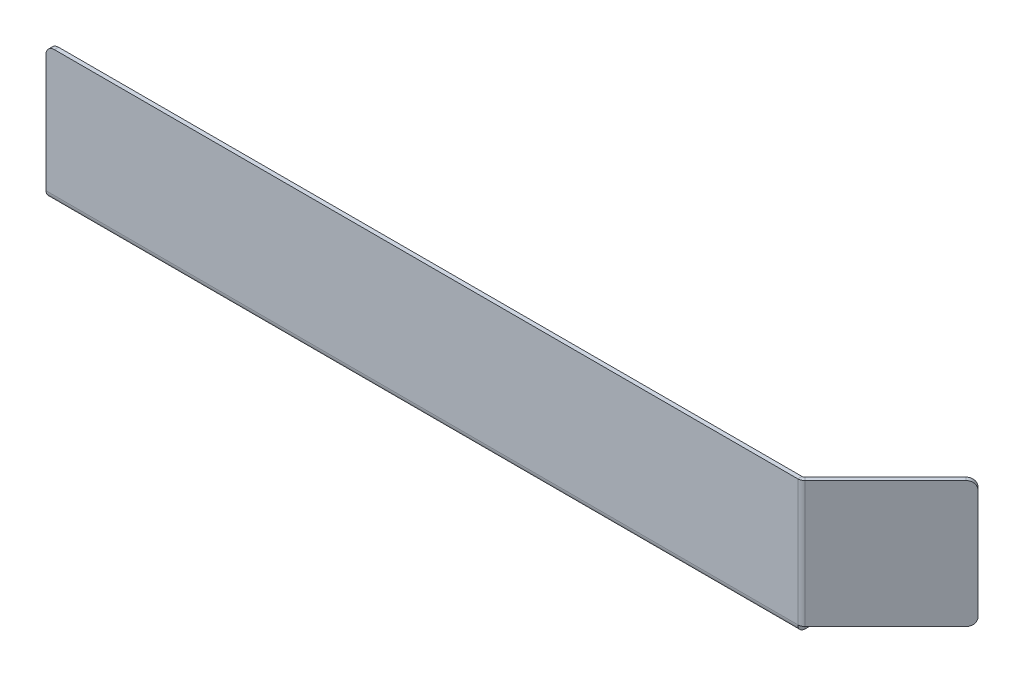
ISO-10303-21;
HEADER;
FILE_DESCRIPTION(('STEP AP214'),'2;1');
FILE_NAME('part.step','',(''),(''),'','','');
FILE_SCHEMA(('AUTOMOTIVE_DESIGN { 1 0 10303 214 1 1 1 1 }'));
ENDSEC;
DATA;
#1=APPLICATION_CONTEXT('core data for automotive mechanical design processes');
#2=APPLICATION_PROTOCOL_DEFINITION('international standard','automotive_design',2000,#1);
#3=PRODUCT_CONTEXT('',#1,'mechanical');
#4=PRODUCT('Part','Part','',(#3));
#5=PRODUCT_RELATED_PRODUCT_CATEGORY('part','',(#4));
#6=PRODUCT_DEFINITION_FORMATION('','',#4);
#7=PRODUCT_DEFINITION_CONTEXT('part definition',#1,'design');
#8=PRODUCT_DEFINITION('design','',#6,#7);
#9=PRODUCT_DEFINITION_SHAPE('','',#8);
#10=(LENGTH_UNIT() NAMED_UNIT(*) SI_UNIT(.MILLI.,.METRE.));
#11=(NAMED_UNIT(*) PLANE_ANGLE_UNIT() SI_UNIT($,.RADIAN.));
#12=(NAMED_UNIT(*) SI_UNIT($,.STERADIAN.) SOLID_ANGLE_UNIT());
#13=UNCERTAINTY_MEASURE_WITH_UNIT(LENGTH_MEASURE(1.E-05),#10,'distance_accuracy_value','');
#14=(GEOMETRIC_REPRESENTATION_CONTEXT(3) GLOBAL_UNCERTAINTY_ASSIGNED_CONTEXT((#13)) GLOBAL_UNIT_ASSIGNED_CONTEXT((#10,
#11,#12)) REPRESENTATION_CONTEXT('',''));
#15=CARTESIAN_POINT('',(0.,0.,0.));
#16=DIRECTION('',(0.,0.,1.));
#17=DIRECTION('',(1.,0.,0.));
#18=AXIS2_PLACEMENT_3D('',#15,#16,#17);
#19=CARTESIAN_POINT('',(-180.,0.,-1.));
#20=DIRECTION('',(-1.,0.,0.));
#21=DIRECTION('',(0.,0.,1.));
#22=AXIS2_PLACEMENT_3D('',#19,#20,#21);
#23=PLANE('',#22);
#24=DIRECTION('',(0.,-1.,0.));
#25=VECTOR('',#24,1.);
#26=CARTESIAN_POINT('',(-180.,0.,0.));
#27=LINE('',#26,#25);
#28=CARTESIAN_POINT('',(-180.,30.,0.));
#29=VERTEX_POINT('',#28);
#30=CARTESIAN_POINT('',(-180.,1.73659999999997,0.));
#31=VERTEX_POINT('',#30);
#32=EDGE_CURVE('E298',#29,#31,#27,.T.);
#33=ORIENTED_EDGE('',*,*,#32,.F.);
#34=DIRECTION('',(0.,0.,1.));
#35=VECTOR('',#34,1.);
#36=CARTESIAN_POINT('',(-180.,30.,-1.));
#37=LINE('',#36,#35);
#38=CARTESIAN_POINT('',(-180.,30.,-1.));
#39=VERTEX_POINT('',#38);
#40=EDGE_CURVE('E334',#29,#39,#37,.F.);
#41=ORIENTED_EDGE('',*,*,#40,.T.);
#42=DIRECTION('',(0.,-1.,0.));
#43=VECTOR('',#42,1.);
#44=CARTESIAN_POINT('',(-180.,0.,-1.));
#45=LINE('',#44,#43);
#46=CARTESIAN_POINT('',(-180.,1.73659999999998,-0.999999999999988));
#47=VERTEX_POINT('',#46);
#48=EDGE_CURVE('E301',#39,#47,#45,.T.);
#49=ORIENTED_EDGE('',*,*,#48,.T.);
#50=DIRECTION('',(0.,0.,1.));
#51=VECTOR('',#50,1.);
#52=CARTESIAN_POINT('',(-180.,1.73659999999998,-0.999999999999988));
#53=LINE('',#52,#51);
#54=EDGE_CURVE('E279',#47,#31,#53,.T.);
#55=ORIENTED_EDGE('',*,*,#54,.T.);
#56=EDGE_LOOP('',(#33,#41,#49,#55));
#57=FACE_BOUND('',#56,.T.);
#58=ADVANCED_FACE('F77',(#57),#23,.T.);
#59=CARTESIAN_POINT('',(0.,0.,-1.));
#60=DIRECTION('',(0.,0.,1.));
#61=DIRECTION('',(1.,0.,0.));
#62=AXIS2_PLACEMENT_3D('',#59,#60,#61);
#63=PLANE('',#62);
#64=ORIENTED_EDGE('',*,*,#48,.F.);
#65=CARTESIAN_POINT('',(-178.,30.,-1.));
#66=DIRECTION('',(0.,0.,1.));
#67=DIRECTION('',(1.,0.,0.));
#68=AXIS2_PLACEMENT_3D('',#65,#66,#67);
#69=CIRCLE('',#68,2.);
#70=CARTESIAN_POINT('',(-178.,32.,-1.));
#71=VERTEX_POINT('',#70);
#72=EDGE_CURVE('E336',#39,#71,#69,.F.);
#73=ORIENTED_EDGE('',*,*,#72,.T.);
#74=DIRECTION('',(-1.,0.,0.));
#75=VECTOR('',#74,1.);
#76=CARTESIAN_POINT('',(0.,32.,-1.));
#77=LINE('',#76,#75);
#78=CARTESIAN_POINT('',(0.,32.,-1.));
#79=VERTEX_POINT('',#78);
#80=EDGE_CURVE('E297',#79,#71,#77,.T.);
#81=ORIENTED_EDGE('',*,*,#80,.F.);
#82=DIRECTION('',(0.,1.,0.));
#83=VECTOR('',#82,1.);
#84=CARTESIAN_POINT('',(0.,0.,-1.));
#85=LINE('',#84,#83);
#86=CARTESIAN_POINT('',(0.,1.73659999999998,-1.00000000000003));
#87=VERTEX_POINT('',#86);
#88=EDGE_CURVE('E295',#87,#79,#85,.T.);
#89=ORIENTED_EDGE('',*,*,#88,.F.);
#90=DIRECTION('',(-1.,0.,0.));
#91=VECTOR('',#90,1.);
#92=CARTESIAN_POINT('',(-180.,1.73659999999998,-0.999999999999988));
#93=LINE('',#92,#91);
#94=EDGE_CURVE('E285',#47,#87,#93,.F.);
#95=ORIENTED_EDGE('',*,*,#94,.F.);
#96=EDGE_LOOP('',(#64,#73,#81,#89,#95));
#97=FACE_BOUND('',#96,.T.);
#98=ADVANCED_FACE('F383',(#97),#63,.F.);
#99=CARTESIAN_POINT('',(0.,0.,0.));
#100=DIRECTION('',(0.,0.,1.));
#101=DIRECTION('',(1.,0.,0.));
#102=AXIS2_PLACEMENT_3D('',#99,#100,#101);
#103=PLANE('',#102);
#104=DIRECTION('',(-1.,0.,0.));
#105=VECTOR('',#104,1.);
#106=CARTESIAN_POINT('',(0.,32.,0.));
#107=LINE('',#106,#105);
#108=CARTESIAN_POINT('',(0.,32.,0.));
#109=VERTEX_POINT('',#108);
#110=CARTESIAN_POINT('',(-178.,32.,0.));
#111=VERTEX_POINT('',#110);
#112=EDGE_CURVE('E305',#109,#111,#107,.T.);
#113=ORIENTED_EDGE('',*,*,#112,.T.);
#114=CARTESIAN_POINT('',(-178.,30.,0.));
#115=DIRECTION('',(0.,0.,1.));
#116=DIRECTION('',(1.,0.,0.));
#117=AXIS2_PLACEMENT_3D('',#114,#115,#116);
#118=CIRCLE('',#117,2.);
#119=EDGE_CURVE('E332',#111,#29,#118,.T.);
#120=ORIENTED_EDGE('',*,*,#119,.T.);
#121=ORIENTED_EDGE('',*,*,#32,.T.);
#122=DIRECTION('',(-1.,0.,0.));
#123=VECTOR('',#122,1.);
#124=CARTESIAN_POINT('',(-180.,1.73659999999997,0.));
#125=LINE('',#124,#123);
#126=CARTESIAN_POINT('',(0.,1.73659999999998,0.));
#127=VERTEX_POINT('',#126);
#128=EDGE_CURVE('E272',#31,#127,#125,.F.);
#129=ORIENTED_EDGE('',*,*,#128,.T.);
#130=DIRECTION('',(0.,1.,0.));
#131=VECTOR('',#130,1.);
#132=CARTESIAN_POINT('',(0.,0.,0.));
#133=LINE('',#132,#131);
#134=EDGE_CURVE('E214',#127,#109,#133,.T.);
#135=ORIENTED_EDGE('',*,*,#134,.T.);
#136=EDGE_LOOP('',(#113,#120,#121,#129,#135));
#137=FACE_BOUND('',#136,.T.);
#138=ADVANCED_FACE('F390',(#137),#103,.T.);
#139=CARTESIAN_POINT('',(0.,32.,-1.));
#140=DIRECTION('',(0.,1.,0.));
#141=DIRECTION('',(-1.,0.,0.));
#142=AXIS2_PLACEMENT_3D('',#139,#140,#141);
#143=PLANE('',#142);
#144=ORIENTED_EDGE('',*,*,#80,.T.);
#145=DIRECTION('',(0.,0.,1.));
#146=VECTOR('',#145,1.);
#147=CARTESIAN_POINT('',(-178.,32.,-1.));
#148=LINE('',#147,#146);
#149=EDGE_CURVE('E329',#71,#111,#148,.T.);
#150=ORIENTED_EDGE('',*,*,#149,.T.);
#151=ORIENTED_EDGE('',*,*,#112,.F.);
#152=DIRECTION('',(0.,0.,1.));
#153=VECTOR('',#152,1.);
#154=CARTESIAN_POINT('',(0.,32.,-1.));
#155=LINE('',#154,#153);
#156=EDGE_CURVE('E303',#79,#109,#155,.T.);
#157=ORIENTED_EDGE('',*,*,#156,.F.);
#158=EDGE_LOOP('',(#144,#150,#151,#157));
#159=FACE_BOUND('',#158,.T.);
#160=ADVANCED_FACE('F379',(#159),#143,.T.);
#161=CARTESIAN_POINT('',(0.,1.73659999999999,-1.73660000000001));
#162=DIRECTION('',(1.,0.,0.));
#163=DIRECTION('',(0.,0.,-1.));
#164=AXIS2_PLACEMENT_3D('',#161,#162,#163);
#165=PLANE('',#164);
#166=DIRECTION('',(0.,-1.,0.));
#167=VECTOR('',#166,1.);
#168=CARTESIAN_POINT('',(0.,0.,-1.73659999999999));
#169=LINE('',#168,#167);
#170=CARTESIAN_POINT('',(0.,0.999999999999997,-1.7366));
#171=VERTEX_POINT('',#170);
#172=CARTESIAN_POINT('',(0.,0.,-1.7366));
#173=VERTEX_POINT('',#172);
#174=EDGE_CURVE('E239',#171,#173,#169,.T.);
#175=ORIENTED_EDGE('',*,*,#174,.F.);
#176=CARTESIAN_POINT('',(0.,1.73659999999999,-1.73660000000001));
#177=DIRECTION('',(-1.,0.,0.));
#178=DIRECTION('',(0.,0.,1.));
#179=AXIS2_PLACEMENT_3D('',#176,#177,#178);
#180=CIRCLE('',#179,0.736599999999992);
#181=EDGE_CURVE('E282',#87,#171,#180,.F.);
#182=ORIENTED_EDGE('',*,*,#181,.F.);
#183=DIRECTION('',(0.,0.,1.));
#184=VECTOR('',#183,1.);
#185=CARTESIAN_POINT('',(0.,1.73659999999998,-1.00000000000001));
#186=LINE('',#185,#184);
#187=EDGE_CURVE('E290',#87,#127,#186,.T.);
#188=ORIENTED_EDGE('',*,*,#187,.T.);
#189=CARTESIAN_POINT('',(0.,1.73659999999999,-1.73660000000001));
#190=DIRECTION('',(-1.,0.,0.));
#191=DIRECTION('',(0.,0.,1.));
#192=AXIS2_PLACEMENT_3D('',#189,#190,#191);
#193=CIRCLE('',#192,1.73659999999999);
#194=EDGE_CURVE('E275',#127,#173,#193,.F.);
#195=ORIENTED_EDGE('',*,*,#194,.T.);
#196=EDGE_LOOP('',(#175,#182,#188,#195));
#197=FACE_BOUND('',#196,.T.);
#198=ADVANCED_FACE('F412',(#197),#165,.T.);
#199=CARTESIAN_POINT('',(-180.,1.73659999999999,-1.73659999999998));
#200=DIRECTION('',(1.,0.,0.));
#201=DIRECTION('',(0.,0.,-1.));
#202=AXIS2_PLACEMENT_3D('',#199,#200,#201);
#203=PLANE('',#202);
#204=CARTESIAN_POINT('',(-180.,1.73659999999999,-1.73659999999998));
#205=DIRECTION('',(-1.,0.,0.));
#206=DIRECTION('',(0.,0.,1.));
#207=AXIS2_PLACEMENT_3D('',#204,#205,#206);
#208=CIRCLE('',#207,0.736599999999992);
#209=CARTESIAN_POINT('',(-180.,0.999999999999997,-1.73659999999998));
#210=VERTEX_POINT('',#209);
#211=EDGE_CURVE('E246',#210,#47,#208,.T.);
#212=ORIENTED_EDGE('',*,*,#211,.F.);
#213=DIRECTION('',(0.,-1.,0.));
#214=VECTOR('',#213,1.);
#215=CARTESIAN_POINT('',(-180.,0.999999999999982,-1.73659999999999));
#216=LINE('',#215,#214);
#217=CARTESIAN_POINT('',(-180.,0.,-1.73659999999998));
#218=VERTEX_POINT('',#217);
#219=EDGE_CURVE('E264',#210,#218,#216,.T.);
#220=ORIENTED_EDGE('',*,*,#219,.T.);
#221=CARTESIAN_POINT('',(-180.,1.73659999999999,-1.73659999999998));
#222=DIRECTION('',(-1.,0.,0.));
#223=DIRECTION('',(0.,0.,1.));
#224=AXIS2_PLACEMENT_3D('',#221,#222,#223);
#225=CIRCLE('',#224,1.73659999999999);
#226=EDGE_CURVE('E276',#218,#31,#225,.T.);
#227=ORIENTED_EDGE('',*,*,#226,.T.);
#228=ORIENTED_EDGE('',*,*,#54,.F.);
#229=EDGE_LOOP('',(#212,#220,#227,#228));
#230=FACE_BOUND('',#229,.T.);
#231=ADVANCED_FACE('F399',(#230),#203,.F.);
#232=CARTESIAN_POINT('',(-180.,1.73659999999999,-1.73659999999998));
#233=DIRECTION('',(-1.,0.,0.));
#234=DIRECTION('',(0.,-1.,0.));
#235=AXIS2_PLACEMENT_3D('',#232,#233,#234);
#236=CYLINDRICAL_SURFACE('',#235,1.73659999999999);
#237=ORIENTED_EDGE('',*,*,#128,.F.);
#238=ORIENTED_EDGE('',*,*,#226,.F.);
#239=DIRECTION('',(-1.,0.,0.));
#240=VECTOR('',#239,1.);
#241=CARTESIAN_POINT('',(0.,0.,-1.73659999999999));
#242=LINE('',#241,#240);
#243=EDGE_CURVE('E261',#173,#218,#242,.T.);
#244=ORIENTED_EDGE('',*,*,#243,.F.);
#245=ORIENTED_EDGE('',*,*,#194,.F.);
#246=EDGE_LOOP('',(#237,#238,#244,#245));
#247=FACE_BOUND('',#246,.T.);
#248=ADVANCED_FACE('F395',(#247),#236,.T.);
#249=CARTESIAN_POINT('',(-180.,1.73659999999999,-1.73659999999998));
#250=DIRECTION('',(-1.,0.,0.));
#251=DIRECTION('',(0.,-1.,0.));
#252=AXIS2_PLACEMENT_3D('',#249,#250,#251);
#253=CYLINDRICAL_SURFACE('',#252,0.736599999999992);
#254=ORIENTED_EDGE('',*,*,#94,.T.);
#255=ORIENTED_EDGE('',*,*,#181,.T.);
#256=DIRECTION('',(1.,0.,0.));
#257=VECTOR('',#256,1.);
#258=CARTESIAN_POINT('',(0.,0.999999999999997,-1.7366));
#259=LINE('',#258,#257);
#260=EDGE_CURVE('E267',#171,#210,#259,.F.);
#261=ORIENTED_EDGE('',*,*,#260,.T.);
#262=ORIENTED_EDGE('',*,*,#211,.T.);
#263=EDGE_LOOP('',(#254,#255,#261,#262));
#264=FACE_BOUND('',#263,.T.);
#265=ADVANCED_FACE('F553',(#264),#253,.F.);
#266=CARTESIAN_POINT('',(-180.,0.,-0.999999999999997));
#267=DIRECTION('',(-1.,0.,0.));
#268=DIRECTION('',(0.,-1.,0.));
#269=AXIS2_PLACEMENT_3D('',#266,#267,#268);
#270=PLANE('',#269);
#271=DIRECTION('',(0.,0.,-1.));
#272=VECTOR('',#271,1.);
#273=CARTESIAN_POINT('',(-180.,0.999999999999988,0.));
#274=LINE('',#273,#272);
#275=CARTESIAN_POINT('',(-180.,0.999999999999932,-16.));
#276=VERTEX_POINT('',#275);
#277=EDGE_CURVE('E253',#276,#210,#274,.F.);
#278=ORIENTED_EDGE('',*,*,#277,.F.);
#279=DIRECTION('',(0.,1.,0.));
#280=VECTOR('',#279,1.);
#281=CARTESIAN_POINT('',(-180.,0.,-16.));
#282=LINE('',#281,#280);
#283=CARTESIAN_POINT('',(-180.,0.,-16.));
#284=VERTEX_POINT('',#283);
#285=EDGE_CURVE('E327',#276,#284,#282,.F.);
#286=ORIENTED_EDGE('',*,*,#285,.T.);
#287=DIRECTION('',(0.,0.,1.));
#288=VECTOR('',#287,1.);
#289=CARTESIAN_POINT('',(-180.,0.,-0.999999999999997));
#290=LINE('',#289,#288);
#291=EDGE_CURVE('E244',#284,#218,#290,.T.);
#292=ORIENTED_EDGE('',*,*,#291,.T.);
#293=ORIENTED_EDGE('',*,*,#219,.F.);
#294=EDGE_LOOP('',(#278,#286,#292,#293));
#295=FACE_BOUND('',#294,.T.);
#296=ADVANCED_FACE('F542',(#295),#270,.T.);
#297=CARTESIAN_POINT('',(0.,0.,-18.));
#298=DIRECTION('',(1.,0.,0.));
#299=DIRECTION('',(0.,1.,0.));
#300=AXIS2_PLACEMENT_3D('',#297,#298,#299);
#301=PLANE('',#300);
#302=DIRECTION('',(0.,0.,-1.));
#303=VECTOR('',#302,1.);
#304=CARTESIAN_POINT('',(0.,0.,-18.));
#305=LINE('',#304,#303);
#306=CARTESIAN_POINT('',(0.,0.,-16.));
#307=VERTEX_POINT('',#306);
#308=EDGE_CURVE('E250',#173,#307,#305,.T.);
#309=ORIENTED_EDGE('',*,*,#308,.T.);
#310=DIRECTION('',(0.,1.,0.));
#311=VECTOR('',#310,1.);
#312=CARTESIAN_POINT('',(0.,0.,-16.));
#313=LINE('',#312,#311);
#314=CARTESIAN_POINT('',(0.,0.999999999999948,-16.));
#315=VERTEX_POINT('',#314);
#316=EDGE_CURVE('E311',#307,#315,#313,.T.);
#317=ORIENTED_EDGE('',*,*,#316,.T.);
#318=DIRECTION('',(0.,0.,1.));
#319=VECTOR('',#318,1.);
#320=CARTESIAN_POINT('',(0.,1.,0.));
#321=LINE('',#320,#319);
#322=EDGE_CURVE('E258',#171,#315,#321,.F.);
#323=ORIENTED_EDGE('',*,*,#322,.F.);
#324=ORIENTED_EDGE('',*,*,#174,.T.);
#325=EDGE_LOOP('',(#309,#317,#323,#324));
#326=FACE_BOUND('',#325,.T.);
#327=ADVANCED_FACE('F531',(#326),#301,.T.);
#328=CARTESIAN_POINT('',(0.,0.,0.));
#329=DIRECTION('',(0.,-1.,0.));
#330=DIRECTION('',(0.,0.,-1.));
#331=AXIS2_PLACEMENT_3D('',#328,#329,#330);
#332=PLANE('',#331);
#333=DIRECTION('',(-1.,0.,0.));
#334=VECTOR('',#333,1.);
#335=CARTESIAN_POINT('',(-180.,0.,-18.));
#336=LINE('',#335,#334);
#337=CARTESIAN_POINT('',(-2.,0.,-18.));
#338=VERTEX_POINT('',#337);
#339=CARTESIAN_POINT('',(-178.,0.,-18.));
#340=VERTEX_POINT('',#339);
#341=EDGE_CURVE('E247',#338,#340,#336,.T.);
#342=ORIENTED_EDGE('',*,*,#341,.F.);
#343=CARTESIAN_POINT('',(-2.,0.,-16.));
#344=DIRECTION('',(0.,-1.,0.));
#345=DIRECTION('',(0.,0.,-1.));
#346=AXIS2_PLACEMENT_3D('',#343,#344,#345);
#347=CIRCLE('',#346,2.);
#348=EDGE_CURVE('E325',#338,#307,#347,.T.);
#349=ORIENTED_EDGE('',*,*,#348,.T.);
#350=ORIENTED_EDGE('',*,*,#308,.F.);
#351=ORIENTED_EDGE('',*,*,#243,.T.);
#352=ORIENTED_EDGE('',*,*,#291,.F.);
#353=CARTESIAN_POINT('',(-178.,0.,-16.));
#354=DIRECTION('',(0.,-1.,0.));
#355=DIRECTION('',(0.,0.,-1.));
#356=AXIS2_PLACEMENT_3D('',#353,#354,#355);
#357=CIRCLE('',#356,2.);
#358=EDGE_CURVE('E323',#284,#340,#357,.T.);
#359=ORIENTED_EDGE('',*,*,#358,.T.);
#360=EDGE_LOOP('',(#342,#349,#350,#351,#352,#359));
#361=FACE_BOUND('',#360,.T.);
#362=ADVANCED_FACE('F520',(#361),#332,.T.);
#363=CARTESIAN_POINT('',(0.,1.,0.));
#364=DIRECTION('',(0.,-1.,0.));
#365=DIRECTION('',(0.,0.,-1.));
#366=AXIS2_PLACEMENT_3D('',#363,#364,#365);
#367=PLANE('',#366);
#368=ORIENTED_EDGE('',*,*,#322,.T.);
#369=CARTESIAN_POINT('',(-2.,0.999999999999947,-16.));
#370=DIRECTION('',(0.,-1.,0.));
#371=DIRECTION('',(0.,0.,-1.));
#372=AXIS2_PLACEMENT_3D('',#369,#370,#371);
#373=CIRCLE('',#372,2.);
#374=CARTESIAN_POINT('',(-2.,0.99999999999994,-18.));
#375=VERTEX_POINT('',#374);
#376=EDGE_CURVE('E316',#315,#375,#373,.F.);
#377=ORIENTED_EDGE('',*,*,#376,.T.);
#378=DIRECTION('',(1.,0.,0.));
#379=VECTOR('',#378,1.);
#380=CARTESIAN_POINT('',(0.,0.999999999999941,-18.));
#381=LINE('',#380,#379);
#382=CARTESIAN_POINT('',(-178.,0.999999999999925,-18.));
#383=VERTEX_POINT('',#382);
#384=EDGE_CURVE('E255',#375,#383,#381,.F.);
#385=ORIENTED_EDGE('',*,*,#384,.T.);
#386=CARTESIAN_POINT('',(-178.,0.999999999999932,-16.));
#387=DIRECTION('',(0.,-1.,0.));
#388=DIRECTION('',(0.,0.,-1.));
#389=AXIS2_PLACEMENT_3D('',#386,#387,#388);
#390=CIRCLE('',#389,2.);
#391=EDGE_CURVE('E314',#383,#276,#390,.F.);
#392=ORIENTED_EDGE('',*,*,#391,.T.);
#393=ORIENTED_EDGE('',*,*,#277,.T.);
#394=ORIENTED_EDGE('',*,*,#260,.F.);
#395=EDGE_LOOP('',(#368,#377,#385,#392,#393,#394));
#396=FACE_BOUND('',#395,.T.);
#397=ADVANCED_FACE('F507',(#396),#367,.F.);
#398=CARTESIAN_POINT('',(-180.,0.,-18.));
#399=DIRECTION('',(0.,0.,-1.));
#400=DIRECTION('',(0.,1.,0.));
#401=AXIS2_PLACEMENT_3D('',#398,#399,#400);
#402=PLANE('',#401);
#403=ORIENTED_EDGE('',*,*,#384,.F.);
#404=DIRECTION('',(0.,1.,0.));
#405=VECTOR('',#404,1.);
#406=CARTESIAN_POINT('',(-2.,0.,-18.));
#407=LINE('',#406,#405);
#408=EDGE_CURVE('E321',#375,#338,#407,.F.);
#409=ORIENTED_EDGE('',*,*,#408,.T.);
#410=ORIENTED_EDGE('',*,*,#341,.T.);
#411=DIRECTION('',(0.,1.,0.));
#412=VECTOR('',#411,1.);
#413=CARTESIAN_POINT('',(-178.,0.,-18.));
#414=LINE('',#413,#412);
#415=EDGE_CURVE('E318',#340,#383,#414,.T.);
#416=ORIENTED_EDGE('',*,*,#415,.T.);
#417=EDGE_LOOP('',(#403,#409,#410,#416));
#418=FACE_BOUND('',#417,.T.);
#419=ADVANCED_FACE('F502',(#418),#402,.T.);
#420=CARTESIAN_POINT('',(0.,32.,-1.7366));
#421=DIRECTION('',(0.,1.,0.));
#422=DIRECTION('',(0.,0.,1.));
#423=AXIS2_PLACEMENT_3D('',#420,#421,#422);
#424=PLANE('',#423);
#425=DIRECTION('',(0.707106781186544,0.,0.707106781186551));
#426=VECTOR('',#425,1.);
#427=CARTESIAN_POINT('',(1.22796163620855,32.,-0.508638363791437));
#428=LINE('',#427,#426);
#429=CARTESIAN_POINT('',(0.520854855022008,32.,-1.21574514497799));
#430=VERTEX_POINT('',#429);
#431=CARTESIAN_POINT('',(1.22796163620855,32.,-0.508638363791435));
#432=VERTEX_POINT('',#431);
#433=EDGE_CURVE('E236',#430,#432,#428,.T.);
#434=ORIENTED_EDGE('',*,*,#433,.F.);
#435=CARTESIAN_POINT('',(0.,32.,-1.7366));
#436=DIRECTION('',(0.,-1.,0.));
#437=DIRECTION('',(0.,0.,-1.));
#438=AXIS2_PLACEMENT_3D('',#435,#436,#437);
#439=CIRCLE('',#438,0.7366);
#440=EDGE_CURVE('E218',#79,#430,#439,.F.);
#441=ORIENTED_EDGE('',*,*,#440,.F.);
#442=ORIENTED_EDGE('',*,*,#156,.T.);
#443=CARTESIAN_POINT('',(0.,32.,-1.7366));
#444=DIRECTION('',(0.,-1.,0.));
#445=DIRECTION('',(0.,0.,-1.));
#446=AXIS2_PLACEMENT_3D('',#443,#444,#445);
#447=CIRCLE('',#446,1.7366);
#448=EDGE_CURVE('E217',#109,#432,#447,.F.);
#449=ORIENTED_EDGE('',*,*,#448,.T.);
#450=EDGE_LOOP('',(#434,#441,#442,#449));
#451=FACE_BOUND('',#450,.T.);
#452=ADVANCED_FACE('F375',(#451),#424,.T.);
#453=CARTESIAN_POINT('',(0.,1.73659999999998,-1.73660000000003));
#454=DIRECTION('',(0.,1.,0.));
#455=DIRECTION('',(0.,0.,1.));
#456=AXIS2_PLACEMENT_3D('',#453,#454,#455);
#457=PLANE('',#456);
#458=CARTESIAN_POINT('',(0.,1.73659999999998,-1.73660000000003));
#459=DIRECTION('',(0.,-1.,0.));
#460=DIRECTION('',(0.,0.,-1.));
#461=AXIS2_PLACEMENT_3D('',#458,#459,#460);
#462=CIRCLE('',#461,0.7366);
#463=CARTESIAN_POINT('',(0.520854855022008,1.73659999999998,-1.21574514497802));
#464=VERTEX_POINT('',#463);
#465=EDGE_CURVE('E204',#464,#87,#462,.T.);
#466=ORIENTED_EDGE('',*,*,#465,.F.);
#467=DIRECTION('',(0.707106781186544,0.,0.707106781186551));
#468=VECTOR('',#467,1.);
#469=CARTESIAN_POINT('',(0.520854855022017,1.73659999999998,-1.21574514497801));
#470=LINE('',#469,#468);
#471=CARTESIAN_POINT('',(1.22796163620856,1.73659999999998,-0.508638363791458));
#472=VERTEX_POINT('',#471);
#473=EDGE_CURVE('E201',#464,#472,#470,.T.);
#474=ORIENTED_EDGE('',*,*,#473,.T.);
#475=CARTESIAN_POINT('',(0.,1.73659999999998,-1.73660000000003));
#476=DIRECTION('',(0.,-1.,0.));
#477=DIRECTION('',(0.,0.,-1.));
#478=AXIS2_PLACEMENT_3D('',#475,#476,#477);
#479=CIRCLE('',#478,1.7366);
#480=EDGE_CURVE('E209',#472,#127,#479,.T.);
#481=ORIENTED_EDGE('',*,*,#480,.T.);
#482=ORIENTED_EDGE('',*,*,#187,.F.);
#483=EDGE_LOOP('',(#466,#474,#481,#482));
#484=FACE_BOUND('',#483,.T.);
#485=ADVANCED_FACE('F221',(#484),#457,.F.);
#486=CARTESIAN_POINT('',(0.,1.73659999999998,-1.73660000000003));
#487=DIRECTION('',(0.,-1.,0.));
#488=DIRECTION('',(0.707106781186544,0.,0.707106781186551));
#489=AXIS2_PLACEMENT_3D('',#486,#487,#488);
#490=CYLINDRICAL_SURFACE('',#489,1.7366);
#491=ORIENTED_EDGE('',*,*,#134,.F.);
#492=ORIENTED_EDGE('',*,*,#480,.F.);
#493=DIRECTION('',(0.,-1.,0.));
#494=VECTOR('',#493,1.);
#495=CARTESIAN_POINT('',(1.22796163620856,0.,-0.508638363791459));
#496=LINE('',#495,#494);
#497=EDGE_CURVE('E211',#432,#472,#496,.T.);
#498=ORIENTED_EDGE('',*,*,#497,.F.);
#499=ORIENTED_EDGE('',*,*,#448,.F.);
#500=EDGE_LOOP('',(#491,#492,#498,#499));
#501=FACE_BOUND('',#500,.T.);
#502=ADVANCED_FACE('F210',(#501),#490,.T.);
#503=CARTESIAN_POINT('',(0.,1.73659999999998,-1.73660000000003));
#504=DIRECTION('',(0.,-1.,0.));
#505=DIRECTION('',(0.707106781186544,0.,0.707106781186551));
#506=AXIS2_PLACEMENT_3D('',#503,#504,#505);
#507=CYLINDRICAL_SURFACE('',#506,0.7366);
#508=ORIENTED_EDGE('',*,*,#88,.T.);
#509=ORIENTED_EDGE('',*,*,#440,.T.);
#510=DIRECTION('',(0.,1.,0.));
#511=VECTOR('',#510,1.);
#512=CARTESIAN_POINT('',(0.520854855022008,32.,-1.21574514497799));
#513=LINE('',#512,#511);
#514=EDGE_CURVE('E223',#430,#464,#513,.F.);
#515=ORIENTED_EDGE('',*,*,#514,.T.);
#516=ORIENTED_EDGE('',*,*,#465,.T.);
#517=EDGE_LOOP('',(#508,#509,#515,#516));
#518=FACE_BOUND('',#517,.T.);
#519=ADVANCED_FACE('F370',(#518),#507,.F.);
#520=CARTESIAN_POINT('',(1.01221649123056,1.73659999999998,-0.292893218813464));
#521=DIRECTION('',(0.,-1.,0.));
#522=DIRECTION('',(0.,0.,-1.));
#523=AXIS2_PLACEMENT_3D('',#520,#521,#522);
#524=PLANE('',#523);
#525=DIRECTION('',(0.707106781186551,0.,-0.707106781186544));
#526=VECTOR('',#525,1.);
#527=CARTESIAN_POINT('',(-0.194890289955989,1.73659999999998,-0.500000000000012));
#528=LINE('',#527,#526);
#529=CARTESIAN_POINT('',(19.811206364454,1.73660000000001,-20.5060966544098));
#530=VERTEX_POINT('',#529);
#531=EDGE_CURVE('E361',#530,#464,#528,.F.);
#532=ORIENTED_EDGE('',*,*,#531,.F.);
#533=DIRECTION('',(-0.707106781186544,0.,-0.707106781186551));
#534=VECTOR('',#533,1.);
#535=CARTESIAN_POINT('',(20.5183131456405,1.73660000000001,-19.7989898732232));
#536=LINE('',#535,#534);
#537=CARTESIAN_POINT('',(20.5183131456405,1.73660000000001,-19.7989898732232));
#538=VERTEX_POINT('',#537);
#539=EDGE_CURVE('E100',#530,#538,#536,.F.);
#540=ORIENTED_EDGE('',*,*,#539,.T.);
#541=DIRECTION('',(-0.707106781186551,0.,0.707106781186544));
#542=VECTOR('',#541,1.);
#543=CARTESIAN_POINT('',(1.01221649123056,1.73659999999998,-0.292893218813464));
#544=LINE('',#543,#542);
#545=EDGE_CURVE('E197',#538,#472,#544,.T.);
#546=ORIENTED_EDGE('',*,*,#545,.T.);
#547=ORIENTED_EDGE('',*,*,#473,.F.);
#548=EDGE_LOOP('',(#532,#540,#546,#547));
#549=FACE_BOUND('',#548,.T.);
#550=ADVANCED_FACE('F199',(#549),#524,.T.);
#551=CARTESIAN_POINT('',(21.9325267080136,32.,-21.2132034355963));
#552=DIRECTION('',(0.,1.,0.));
#553=DIRECTION('',(0.,0.,1.));
#554=AXIS2_PLACEMENT_3D('',#551,#552,#553);
#555=PLANE('',#554);
#556=DIRECTION('',(0.707106781186551,0.,-0.707106781186544));
#557=VECTOR('',#556,1.);
#558=CARTESIAN_POINT('',(21.9325267080136,32.,-21.2132034355963));
#559=LINE('',#558,#557);
#560=CARTESIAN_POINT('',(20.5183131456405,32.,-19.7989898732232));
#561=VERTEX_POINT('',#560);
#562=EDGE_CURVE('E226',#432,#561,#559,.T.);
#563=ORIENTED_EDGE('',*,*,#562,.T.);
#564=DIRECTION('',(-0.707106781186544,0.,-0.707106781186551));
#565=VECTOR('',#564,1.);
#566=CARTESIAN_POINT('',(20.5183131456405,32.,-19.7989898732232));
#567=LINE('',#566,#565);
#568=CARTESIAN_POINT('',(19.811206364454,32.,-20.5060966544098));
#569=VERTEX_POINT('',#568);
#570=EDGE_CURVE('E13',#561,#569,#567,.T.);
#571=ORIENTED_EDGE('',*,*,#570,.T.);
#572=DIRECTION('',(-0.707106781186551,0.,0.707106781186544));
#573=VECTOR('',#572,1.);
#574=CARTESIAN_POINT('',(-0.194890289955986,32.,-0.5));
#575=LINE('',#574,#573);
#576=EDGE_CURVE('E227',#430,#569,#575,.F.);
#577=ORIENTED_EDGE('',*,*,#576,.F.);
#578=ORIENTED_EDGE('',*,*,#433,.T.);
#579=EDGE_LOOP('',(#563,#571,#577,#578));
#580=FACE_BOUND('',#579,.T.);
#581=ADVANCED_FACE('F366',(#580),#555,.T.);
#582=CARTESIAN_POINT('',(0.512216491230555,0.,0.207106781186538));
#583=DIRECTION('',(0.707106781186544,0.,0.707106781186551));
#584=DIRECTION('',(0.707106781186551,0.,-0.707106781186544));
#585=AXIS2_PLACEMENT_3D('',#582,#583,#584);
#586=PLANE('',#585);
#587=ORIENTED_EDGE('',*,*,#545,.F.);
#588=CARTESIAN_POINT('',(20.5183131456405,3.73660000000001,-19.7989898732232));
#589=DIRECTION('',(0.707106781186544,0.,0.707106781186551));
#590=DIRECTION('',(0.707106781186551,0.,-0.707106781186544));
#591=AXIS2_PLACEMENT_3D('',#588,#589,#590);
#592=CIRCLE('',#591,2.);
#593=CARTESIAN_POINT('',(21.9325267080136,3.73660000000001,-21.2132034355963));
#594=VERTEX_POINT('',#593);
#595=EDGE_CURVE('E85',#538,#594,#592,.T.);
#596=ORIENTED_EDGE('',*,*,#595,.T.);
#597=DIRECTION('',(0.,-1.,0.));
#598=VECTOR('',#597,1.);
#599=CARTESIAN_POINT('',(21.9325267080136,1.73660000000001,-21.2132034355963));
#600=LINE('',#599,#598);
#601=CARTESIAN_POINT('',(21.9325267080136,30.,-21.2132034355963));
#602=VERTEX_POINT('',#601);
#603=EDGE_CURVE('E205',#602,#594,#600,.T.);
#604=ORIENTED_EDGE('',*,*,#603,.F.);
#605=CARTESIAN_POINT('',(20.5183131456405,30.,-19.7989898732232));
#606=DIRECTION('',(0.707106781186544,0.,0.707106781186551));
#607=DIRECTION('',(0.707106781186551,0.,-0.707106781186544));
#608=AXIS2_PLACEMENT_3D('',#605,#606,#607);
#609=CIRCLE('',#608,2.);
#610=EDGE_CURVE('E92',#602,#561,#609,.T.);
#611=ORIENTED_EDGE('',*,*,#610,.T.);
#612=ORIENTED_EDGE('',*,*,#562,.F.);
#613=ORIENTED_EDGE('',*,*,#497,.T.);
#614=EDGE_LOOP('',(#587,#596,#604,#611,#612,#613));
#615=FACE_BOUND('',#614,.T.);
#616=ADVANCED_FACE('F225',(#615),#586,.T.);
#617=CARTESIAN_POINT('',(-0.194890289955988,0.,-0.500000000000013));
#618=DIRECTION('',(0.707106781186544,0.,0.707106781186551));
#619=DIRECTION('',(0.707106781186551,0.,-0.707106781186544));
#620=AXIS2_PLACEMENT_3D('',#617,#618,#619);
#621=PLANE('',#620);
#622=DIRECTION('',(0.,1.,0.));
#623=VECTOR('',#622,1.);
#624=CARTESIAN_POINT('',(21.2254199268271,0.,-21.9203102167829));
#625=LINE('',#624,#623);
#626=CARTESIAN_POINT('',(21.2254199268271,30.,-21.9203102167829));
#627=VERTEX_POINT('',#626);
#628=CARTESIAN_POINT('',(21.2254199268271,3.73660000000001,-21.9203102167829));
#629=VERTEX_POINT('',#628);
#630=EDGE_CURVE('E230',#627,#629,#625,.F.);
#631=ORIENTED_EDGE('',*,*,#630,.T.);
#632=CARTESIAN_POINT('',(19.811206364454,3.73660000000001,-20.5060966544098));
#633=DIRECTION('',(0.707106781186544,0.,0.707106781186551));
#634=DIRECTION('',(0.707106781186551,0.,-0.707106781186544));
#635=AXIS2_PLACEMENT_3D('',#632,#633,#634);
#636=CIRCLE('',#635,2.);
#637=EDGE_CURVE('E345',#629,#530,#636,.F.);
#638=ORIENTED_EDGE('',*,*,#637,.T.);
#639=ORIENTED_EDGE('',*,*,#531,.T.);
#640=ORIENTED_EDGE('',*,*,#514,.F.);
#641=ORIENTED_EDGE('',*,*,#576,.T.);
#642=CARTESIAN_POINT('',(19.811206364454,30.,-20.5060966544098));
#643=DIRECTION('',(0.707106781186544,0.,0.707106781186551));
#644=DIRECTION('',(0.707106781186551,0.,-0.707106781186544));
#645=AXIS2_PLACEMENT_3D('',#642,#643,#644);
#646=CIRCLE('',#645,2.);
#647=EDGE_CURVE('E343',#569,#627,#646,.F.);
#648=ORIENTED_EDGE('',*,*,#647,.T.);
#649=EDGE_LOOP('',(#631,#638,#639,#640,#641,#648));
#650=FACE_BOUND('',#649,.T.);
#651=ADVANCED_FACE('F359',(#650),#621,.F.);
#652=CARTESIAN_POINT('',(21.9325267080136,1.73660000000001,-21.2132034355963));
#653=DIRECTION('',(0.707106781186551,0.,-0.707106781186544));
#654=DIRECTION('',(-0.707106781186544,0.,-0.707106781186551));
#655=AXIS2_PLACEMENT_3D('',#652,#653,#654);
#656=PLANE('',#655);
#657=ORIENTED_EDGE('',*,*,#603,.T.);
#658=DIRECTION('',(-0.707106781186544,0.,-0.707106781186551));
#659=VECTOR('',#658,1.);
#660=CARTESIAN_POINT('',(21.9325267080136,3.73660000000001,-21.2132034355963));
#661=LINE('',#660,#659);
#662=EDGE_CURVE('E340',#594,#629,#661,.T.);
#663=ORIENTED_EDGE('',*,*,#662,.T.);
#664=ORIENTED_EDGE('',*,*,#630,.F.);
#665=DIRECTION('',(-0.707106781186544,0.,-0.707106781186551));
#666=VECTOR('',#665,1.);
#667=CARTESIAN_POINT('',(21.9325267080136,30.,-21.2132034355963));
#668=LINE('',#667,#666);
#669=EDGE_CURVE('E338',#627,#602,#668,.F.);
#670=ORIENTED_EDGE('',*,*,#669,.T.);
#671=EDGE_LOOP('',(#657,#663,#664,#670));
#672=FACE_BOUND('',#671,.T.);
#673=ADVANCED_FACE('F352',(#672),#656,.T.);
#674=CARTESIAN_POINT('',(-2.,0.,-16.));
#675=DIRECTION('',(0.,1.,0.));
#676=DIRECTION('',(0.,0.,1.));
#677=AXIS2_PLACEMENT_3D('',#674,#675,#676);
#678=CYLINDRICAL_SURFACE('',#677,2.);
#679=ORIENTED_EDGE('',*,*,#348,.F.);
#680=ORIENTED_EDGE('',*,*,#408,.F.);
#681=ORIENTED_EDGE('',*,*,#376,.F.);
#682=ORIENTED_EDGE('',*,*,#316,.F.);
#683=EDGE_LOOP('',(#679,#680,#681,#682));
#684=FACE_BOUND('',#683,.T.);
#685=ADVANCED_FACE('F413',(#684),#678,.T.);
#686=CARTESIAN_POINT('',(-178.,0.,-16.));
#687=DIRECTION('',(0.,1.,0.));
#688=DIRECTION('',(0.,0.,1.));
#689=AXIS2_PLACEMENT_3D('',#686,#687,#688);
#690=CYLINDRICAL_SURFACE('',#689,2.);
#691=ORIENTED_EDGE('',*,*,#358,.F.);
#692=ORIENTED_EDGE('',*,*,#285,.F.);
#693=ORIENTED_EDGE('',*,*,#391,.F.);
#694=ORIENTED_EDGE('',*,*,#415,.F.);
#695=EDGE_LOOP('',(#691,#692,#693,#694));
#696=FACE_BOUND('',#695,.T.);
#697=ADVANCED_FACE('F416',(#696),#690,.T.);
#698=CARTESIAN_POINT('',(-178.,30.,-1.));
#699=DIRECTION('',(0.,0.,1.));
#700=DIRECTION('',(1.,0.,0.));
#701=AXIS2_PLACEMENT_3D('',#698,#699,#700);
#702=CYLINDRICAL_SURFACE('',#701,2.);
#703=ORIENTED_EDGE('',*,*,#72,.F.);
#704=ORIENTED_EDGE('',*,*,#40,.F.);
#705=ORIENTED_EDGE('',*,*,#119,.F.);
#706=ORIENTED_EDGE('',*,*,#149,.F.);
#707=EDGE_LOOP('',(#703,#704,#705,#706));
#708=FACE_BOUND('',#707,.T.);
#709=ADVANCED_FACE('F388',(#708),#702,.T.);
#710=CARTESIAN_POINT('',(20.5183131456405,3.73660000000001,-19.7989898732232));
#711=DIRECTION('',(-0.707106781186544,0.,-0.707106781186551));
#712=DIRECTION('',(-0.707106781186551,0.,0.707106781186544));
#713=AXIS2_PLACEMENT_3D('',#710,#711,#712);
#714=CYLINDRICAL_SURFACE('',#713,2.);
#715=ORIENTED_EDGE('',*,*,#595,.F.);
#716=ORIENTED_EDGE('',*,*,#539,.F.);
#717=ORIENTED_EDGE('',*,*,#637,.F.);
#718=ORIENTED_EDGE('',*,*,#662,.F.);
#719=EDGE_LOOP('',(#715,#716,#717,#718));
#720=FACE_BOUND('',#719,.T.);
#721=ADVANCED_FACE('F357',(#720),#714,.T.);
#722=CARTESIAN_POINT('',(20.5183131456405,30.,-19.7989898732232));
#723=DIRECTION('',(-0.707106781186544,0.,-0.707106781186551));
#724=DIRECTION('',(-0.707106781186551,0.,0.707106781186544));
#725=AXIS2_PLACEMENT_3D('',#722,#723,#724);
#726=CYLINDRICAL_SURFACE('',#725,2.);
#727=ORIENTED_EDGE('',*,*,#610,.F.);
#728=ORIENTED_EDGE('',*,*,#669,.F.);
#729=ORIENTED_EDGE('',*,*,#647,.F.);
#730=ORIENTED_EDGE('',*,*,#570,.F.);
#731=EDGE_LOOP('',(#727,#728,#729,#730));
#732=FACE_BOUND('',#731,.T.);
#733=ADVANCED_FACE('F79',(#732),#726,.T.);
#734=CLOSED_SHELL('',(#58,#98,#138,#160,#198,#231,#248,#265,#296,#327,#362,#397,#419,#452,#485,
#502,#519,#550,#581,#616,#651,#673,#685,#697,#709,#721,#733));
#735=MANIFOLD_SOLID_BREP('B2',#734);
#736=ADVANCED_BREP_SHAPE_REPRESENTATION('',(#18,#735),#14);
#737=SHAPE_DEFINITION_REPRESENTATION(#9,#736);
ENDSEC;
END-ISO-10303-21;
